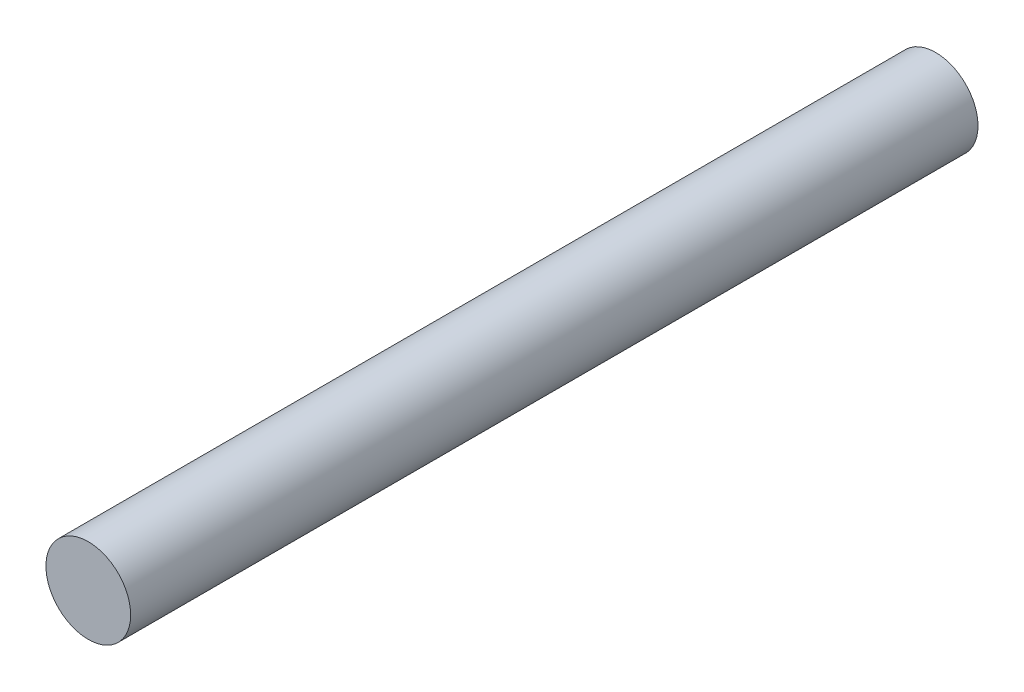
ISO-10303-21;
HEADER;
FILE_DESCRIPTION(('STEP AP214'),'2;1');
FILE_NAME('part.step','',(''),(''),'','','');
FILE_SCHEMA(('AUTOMOTIVE_DESIGN { 1 0 10303 214 1 1 1 1 }'));
ENDSEC;
DATA;
#1=APPLICATION_CONTEXT('core data for automotive mechanical design processes');
#2=APPLICATION_PROTOCOL_DEFINITION('international standard','automotive_design',2000,#1);
#3=PRODUCT_CONTEXT('',#1,'mechanical');
#4=PRODUCT('Part','Part','',(#3));
#5=PRODUCT_RELATED_PRODUCT_CATEGORY('part','',(#4));
#6=PRODUCT_DEFINITION_FORMATION('','',#4);
#7=PRODUCT_DEFINITION_CONTEXT('part definition',#1,'design');
#8=PRODUCT_DEFINITION('design','',#6,#7);
#9=PRODUCT_DEFINITION_SHAPE('','',#8);
#10=(LENGTH_UNIT() NAMED_UNIT(*) SI_UNIT(.MILLI.,.METRE.));
#11=(NAMED_UNIT(*) PLANE_ANGLE_UNIT() SI_UNIT($,.RADIAN.));
#12=(NAMED_UNIT(*) SI_UNIT($,.STERADIAN.) SOLID_ANGLE_UNIT());
#13=UNCERTAINTY_MEASURE_WITH_UNIT(LENGTH_MEASURE(1.E-05),#10,'distance_accuracy_value','');
#14=(GEOMETRIC_REPRESENTATION_CONTEXT(3) GLOBAL_UNCERTAINTY_ASSIGNED_CONTEXT((#13)) GLOBAL_UNIT_ASSIGNED_CONTEXT((#10,
#11,#12)) REPRESENTATION_CONTEXT('',''));
#15=CARTESIAN_POINT('',(0.,0.,0.));
#16=DIRECTION('',(0.,0.,1.));
#17=DIRECTION('',(1.,0.,0.));
#18=AXIS2_PLACEMENT_3D('',#15,#16,#17);
#19=CARTESIAN_POINT('',(0.,0.,30.));
#20=DIRECTION('',(0.,0.,-1.));
#21=DIRECTION('',(-1.,0.,0.));
#22=AXIS2_PLACEMENT_3D('',#19,#20,#21);
#23=CYLINDRICAL_SURFACE('',#22,1.5);
#24=CARTESIAN_POINT('',(0.,0.,30.));
#25=DIRECTION('',(0.,0.,1.));
#26=DIRECTION('',(1.,0.,0.));
#27=AXIS2_PLACEMENT_3D('',#24,#25,#26);
#28=CIRCLE('',#27,1.5);
#29=CARTESIAN_POINT('',(1.5,0.,30.));
#30=VERTEX_POINT('',#29);
#31=EDGE_CURVE('E10',#30,#30,#28,.T.);
#32=ORIENTED_EDGE('',*,*,#31,.F.);
#33=EDGE_LOOP('',(#32));
#34=FACE_BOUND('',#33,.T.);
#35=CARTESIAN_POINT('',(0.,0.,0.));
#36=DIRECTION('',(0.,0.,1.));
#37=DIRECTION('',(1.,0.,0.));
#38=AXIS2_PLACEMENT_3D('',#35,#36,#37);
#39=CIRCLE('',#38,1.5);
#40=CARTESIAN_POINT('',(1.5,0.,0.));
#41=VERTEX_POINT('',#40);
#42=EDGE_CURVE('E40',#41,#41,#39,.T.);
#43=ORIENTED_EDGE('',*,*,#42,.T.);
#44=EDGE_LOOP('',(#43));
#45=FACE_BOUND('',#44,.T.);
#46=ADVANCED_FACE('F37',(#34,#45),#23,.T.);
#47=CARTESIAN_POINT('',(0.,0.,30.));
#48=DIRECTION('',(0.,0.,1.));
#49=DIRECTION('',(1.,0.,0.));
#50=AXIS2_PLACEMENT_3D('',#47,#48,#49);
#51=PLANE('',#50);
#52=ORIENTED_EDGE('',*,*,#31,.T.);
#53=EDGE_LOOP('',(#52));
#54=FACE_BOUND('',#53,.T.);
#55=ADVANCED_FACE('F54',(#54),#51,.T.);
#56=CARTESIAN_POINT('',(0.,0.,0.));
#57=DIRECTION('',(0.,0.,1.));
#58=DIRECTION('',(1.,0.,0.));
#59=AXIS2_PLACEMENT_3D('',#56,#57,#58);
#60=PLANE('',#59);
#61=ORIENTED_EDGE('',*,*,#42,.F.);
#62=EDGE_LOOP('',(#61));
#63=FACE_BOUND('',#62,.T.);
#64=ADVANCED_FACE('F52',(#63),#60,.F.);
#65=CLOSED_SHELL('',(#46,#55,#64));
#66=MANIFOLD_SOLID_BREP('B2',#65);
#67=ADVANCED_BREP_SHAPE_REPRESENTATION('',(#18,#66),#14);
#68=SHAPE_DEFINITION_REPRESENTATION(#9,#67);
ENDSEC;
END-ISO-10303-21;
